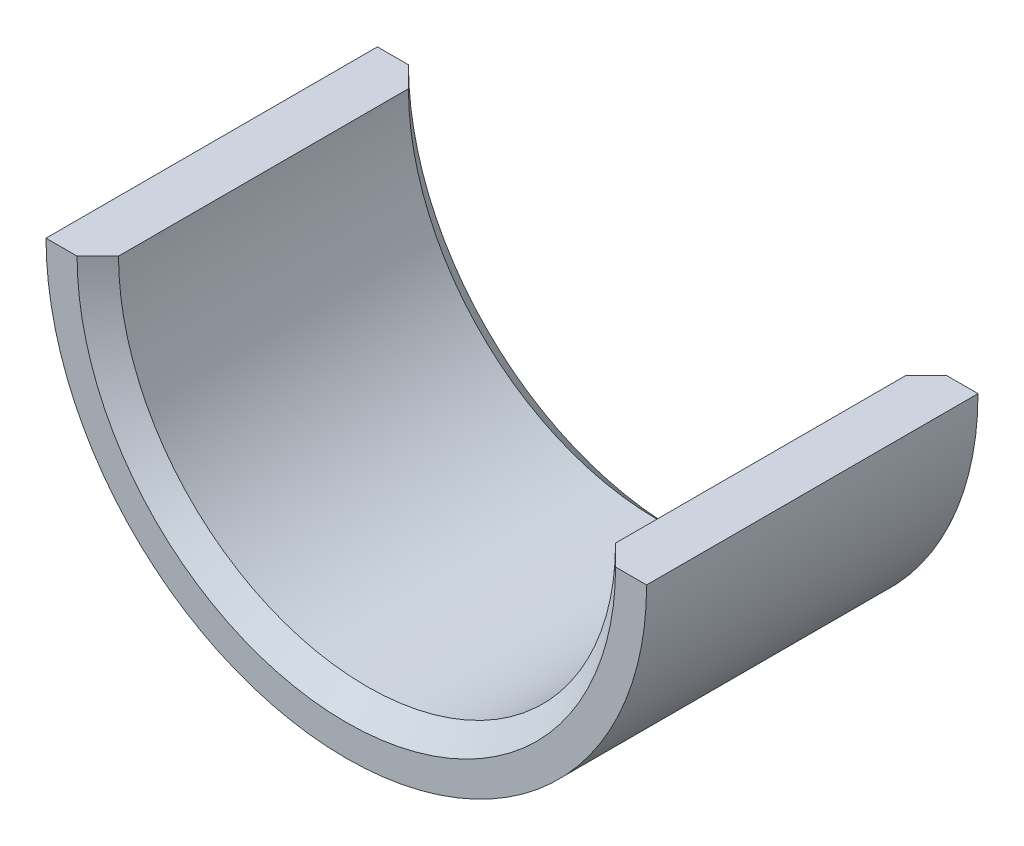
ISO-10303-21;
HEADER;
FILE_DESCRIPTION(('STEP AP214'),'2;1');
FILE_NAME('part.step','',(''),(''),'','','');
FILE_SCHEMA(('AUTOMOTIVE_DESIGN { 1 0 10303 214 1 1 1 1 }'));
ENDSEC;
DATA;
#1=APPLICATION_CONTEXT('core data for automotive mechanical design processes');
#2=APPLICATION_PROTOCOL_DEFINITION('international standard','automotive_design',2000,#1);
#3=PRODUCT_CONTEXT('',#1,'mechanical');
#4=PRODUCT('Part','Part','',(#3));
#5=PRODUCT_RELATED_PRODUCT_CATEGORY('part','',(#4));
#6=PRODUCT_DEFINITION_FORMATION('','',#4);
#7=PRODUCT_DEFINITION_CONTEXT('part definition',#1,'design');
#8=PRODUCT_DEFINITION('design','',#6,#7);
#9=PRODUCT_DEFINITION_SHAPE('','',#8);
#10=(LENGTH_UNIT() NAMED_UNIT(*) SI_UNIT(.MILLI.,.METRE.));
#11=(NAMED_UNIT(*) PLANE_ANGLE_UNIT() SI_UNIT($,.RADIAN.));
#12=(NAMED_UNIT(*) SI_UNIT($,.STERADIAN.) SOLID_ANGLE_UNIT());
#13=UNCERTAINTY_MEASURE_WITH_UNIT(LENGTH_MEASURE(1.E-05),#10,'distance_accuracy_value','');
#14=(GEOMETRIC_REPRESENTATION_CONTEXT(3) GLOBAL_UNCERTAINTY_ASSIGNED_CONTEXT((#13)) GLOBAL_UNIT_ASSIGNED_CONTEXT((#10,
#11,#12)) REPRESENTATION_CONTEXT('',''));
#15=CARTESIAN_POINT('',(0.,0.,0.));
#16=DIRECTION('',(0.,0.,1.));
#17=DIRECTION('',(1.,0.,0.));
#18=AXIS2_PLACEMENT_3D('',#15,#16,#17);
#19=CARTESIAN_POINT('',(34.3713198515824,-30.64120754575,14.01));
#20=DIRECTION('',(0.,-1.,0.));
#21=DIRECTION('',(0.,0.,-1.));
#22=AXIS2_PLACEMENT_3D('',#19,#20,#21);
#23=PLANE('',#22);
#24=DIRECTION('',(1.,0.,0.));
#25=VECTOR('',#24,1.);
#26=CARTESIAN_POINT('',(0.,-30.64120754575,14.));
#27=LINE('',#26,#25);
#28=CARTESIAN_POINT('',(-14.5,-30.64120754575,14.));
#29=VERTEX_POINT('',#28);
#30=CARTESIAN_POINT('',(-13.,-30.64120754575,14.));
#31=VERTEX_POINT('',#30);
#32=EDGE_CURVE('E104',#29,#31,#27,.T.);
#33=ORIENTED_EDGE('',*,*,#32,.T.);
#34=DIRECTION('',(0.707106781186553,0.,-0.707106781186542));
#35=VECTOR('',#34,1.);
#36=CARTESIAN_POINT('',(0.,-30.64120754575,1.00000000000018));
#37=LINE('',#36,#35);
#38=CARTESIAN_POINT('',(-12.,-30.64120754575,13.));
#39=VERTEX_POINT('',#38);
#40=EDGE_CURVE('E118',#31,#39,#37,.T.);
#41=ORIENTED_EDGE('',*,*,#40,.T.);
#42=DIRECTION('',(0.,0.,-1.));
#43=VECTOR('',#42,1.);
#44=CARTESIAN_POINT('',(-12.,-30.64120754575,12.));
#45=LINE('',#44,#43);
#46=CARTESIAN_POINT('',(-12.,-30.64120754575,-0.99999999999999));
#47=VERTEX_POINT('',#46);
#48=EDGE_CURVE('E103',#39,#47,#45,.T.);
#49=ORIENTED_EDGE('',*,*,#48,.T.);
#50=DIRECTION('',(-0.707106781186548,0.,-0.707106781186547));
#51=VECTOR('',#50,1.);
#52=CARTESIAN_POINT('',(0.,-30.64120754575,11.));
#53=LINE('',#52,#51);
#54=CARTESIAN_POINT('',(-13.,-30.64120754575,-2.));
#55=VERTEX_POINT('',#54);
#56=EDGE_CURVE('E111',#47,#55,#53,.T.);
#57=ORIENTED_EDGE('',*,*,#56,.T.);
#58=DIRECTION('',(1.,0.,0.));
#59=VECTOR('',#58,1.);
#60=CARTESIAN_POINT('',(0.,-30.64120754575,-2.));
#61=LINE('',#60,#59);
#62=CARTESIAN_POINT('',(-14.5,-30.64120754575,-2.));
#63=VERTEX_POINT('',#62);
#64=EDGE_CURVE('E124',#63,#55,#61,.T.);
#65=ORIENTED_EDGE('',*,*,#64,.F.);
#66=DIRECTION('',(0.,0.,-1.));
#67=VECTOR('',#66,1.);
#68=CARTESIAN_POINT('',(-14.5,-30.64120754575,14.01));
#69=LINE('',#68,#67);
#70=EDGE_CURVE('E64',#63,#29,#69,.F.);
#71=ORIENTED_EDGE('',*,*,#70,.T.);
#72=EDGE_LOOP('',(#33,#41,#49,#57,#65,#71));
#73=FACE_BOUND('',#72,.T.);
#74=ADVANCED_FACE('F39',(#73),#23,.F.);
#75=CARTESIAN_POINT('',(13.,-30.64120754575,14.));
#76=VERTEX_POINT('',#75);
#77=CARTESIAN_POINT('',(14.5,-30.64120754575,14.));
#78=VERTEX_POINT('',#77);
#79=EDGE_CURVE('E128',#76,#78,#27,.T.);
#80=ORIENTED_EDGE('',*,*,#79,.T.);
#81=DIRECTION('',(0.,0.,-1.));
#82=VECTOR('',#81,1.);
#83=CARTESIAN_POINT('',(14.5,-30.64120754575,14.01));
#84=LINE('',#83,#82);
#85=CARTESIAN_POINT('',(14.5,-30.64120754575,-2.));
#86=VERTEX_POINT('',#85);
#87=EDGE_CURVE('E43',#78,#86,#84,.T.);
#88=ORIENTED_EDGE('',*,*,#87,.T.);
#89=CARTESIAN_POINT('',(13.,-30.64120754575,-2.));
#90=VERTEX_POINT('',#89);
#91=EDGE_CURVE('E56',#90,#86,#61,.T.);
#92=ORIENTED_EDGE('',*,*,#91,.F.);
#93=DIRECTION('',(-0.707106781186548,0.,0.707106781186547));
#94=VECTOR('',#93,1.);
#95=CARTESIAN_POINT('',(0.,-30.64120754575,11.));
#96=LINE('',#95,#94);
#97=CARTESIAN_POINT('',(12.,-30.64120754575,-0.99999999999999));
#98=VERTEX_POINT('',#97);
#99=EDGE_CURVE('E106',#90,#98,#96,.T.);
#100=ORIENTED_EDGE('',*,*,#99,.T.);
#101=DIRECTION('',(0.,0.,-1.));
#102=VECTOR('',#101,1.);
#103=CARTESIAN_POINT('',(12.,-30.64120754575,12.));
#104=LINE('',#103,#102);
#105=CARTESIAN_POINT('',(12.,-30.64120754575,13.));
#106=VERTEX_POINT('',#105);
#107=EDGE_CURVE('E97',#98,#106,#104,.F.);
#108=ORIENTED_EDGE('',*,*,#107,.T.);
#109=DIRECTION('',(0.707106781186553,0.,0.707106781186542));
#110=VECTOR('',#109,1.);
#111=CARTESIAN_POINT('',(0.,-30.64120754575,1.00000000000018));
#112=LINE('',#111,#110);
#113=EDGE_CURVE('E130',#106,#76,#112,.T.);
#114=ORIENTED_EDGE('',*,*,#113,.T.);
#115=EDGE_LOOP('',(#80,#88,#92,#100,#108,#114));
#116=FACE_BOUND('',#115,.T.);
#117=ADVANCED_FACE('F108',(#116),#23,.F.);
#118=CARTESIAN_POINT('',(0.,-30.64120754575,14.01));
#119=DIRECTION('',(0.,0.,-1.));
#120=DIRECTION('',(-1.,0.,0.));
#121=AXIS2_PLACEMENT_3D('',#118,#119,#120);
#122=CYLINDRICAL_SURFACE('',#121,14.5);
#123=CARTESIAN_POINT('',(0.,-30.64120754575,14.));
#124=DIRECTION('',(0.,0.,1.));
#125=DIRECTION('',(1.,0.,0.));
#126=AXIS2_PLACEMENT_3D('',#123,#124,#125);
#127=CIRCLE('',#126,14.5);
#128=EDGE_CURVE('E137',#29,#78,#127,.T.);
#129=ORIENTED_EDGE('',*,*,#128,.F.);
#130=ORIENTED_EDGE('',*,*,#70,.F.);
#131=CARTESIAN_POINT('',(0.,-30.64120754575,-2.));
#132=DIRECTION('',(0.,0.,1.));
#133=DIRECTION('',(1.,0.,0.));
#134=AXIS2_PLACEMENT_3D('',#131,#132,#133);
#135=CIRCLE('',#134,14.5);
#136=EDGE_CURVE('E122',#63,#86,#135,.T.);
#137=ORIENTED_EDGE('',*,*,#136,.T.);
#138=ORIENTED_EDGE('',*,*,#87,.F.);
#139=EDGE_LOOP('',(#129,#130,#137,#138));
#140=FACE_BOUND('',#139,.T.);
#141=ADVANCED_FACE('F135',(#140),#122,.T.);
#142=CARTESIAN_POINT('',(0.,-30.64120754575,14.));
#143=DIRECTION('',(0.,0.,1.));
#144=DIRECTION('',(1.,0.,0.));
#145=AXIS2_PLACEMENT_3D('',#142,#143,#144);
#146=PLANE('',#145);
#147=ORIENTED_EDGE('',*,*,#32,.F.);
#148=ORIENTED_EDGE('',*,*,#128,.T.);
#149=ORIENTED_EDGE('',*,*,#79,.F.);
#150=CARTESIAN_POINT('',(0.,-30.64120754575,14.));
#151=DIRECTION('',(0.,0.,1.));
#152=DIRECTION('',(1.,0.,0.));
#153=AXIS2_PLACEMENT_3D('',#150,#151,#152);
#154=CIRCLE('',#153,13.);
#155=EDGE_CURVE('E140',#76,#31,#154,.F.);
#156=ORIENTED_EDGE('',*,*,#155,.T.);
#157=EDGE_LOOP('',(#147,#148,#149,#156));
#158=FACE_BOUND('',#157,.T.);
#159=ADVANCED_FACE('F145',(#158),#146,.T.);
#160=CARTESIAN_POINT('',(0.,-30.64120754575,-2.));
#161=DIRECTION('',(0.,0.,1.));
#162=DIRECTION('',(1.,0.,0.));
#163=AXIS2_PLACEMENT_3D('',#160,#161,#162);
#164=PLANE('',#163);
#165=ORIENTED_EDGE('',*,*,#136,.F.);
#166=ORIENTED_EDGE('',*,*,#64,.T.);
#167=CARTESIAN_POINT('',(0.,-30.64120754575,-2.));
#168=DIRECTION('',(0.,0.,1.));
#169=DIRECTION('',(1.,0.,0.));
#170=AXIS2_PLACEMENT_3D('',#167,#168,#169);
#171=CIRCLE('',#170,13.);
#172=EDGE_CURVE('E116',#55,#90,#171,.T.);
#173=ORIENTED_EDGE('',*,*,#172,.T.);
#174=ORIENTED_EDGE('',*,*,#91,.T.);
#175=EDGE_LOOP('',(#165,#166,#173,#174));
#176=FACE_BOUND('',#175,.T.);
#177=ADVANCED_FACE('F41',(#176),#164,.F.);
#178=CARTESIAN_POINT('',(0.,-30.64120754575,12.));
#179=DIRECTION('',(0.,0.,-1.));
#180=DIRECTION('',(-1.,0.,0.));
#181=AXIS2_PLACEMENT_3D('',#178,#179,#180);
#182=CYLINDRICAL_SURFACE('',#181,12.);
#183=ORIENTED_EDGE('',*,*,#48,.F.);
#184=CARTESIAN_POINT('',(0.,-30.64120754575,13.));
#185=DIRECTION('',(0.,0.,1.));
#186=DIRECTION('',(1.,0.,0.));
#187=AXIS2_PLACEMENT_3D('',#184,#185,#186);
#188=CIRCLE('',#187,12.);
#189=EDGE_CURVE('E48',#39,#106,#188,.T.);
#190=ORIENTED_EDGE('',*,*,#189,.T.);
#191=ORIENTED_EDGE('',*,*,#107,.F.);
#192=CARTESIAN_POINT('',(0.,-30.64120754575,-0.99999999999999));
#193=DIRECTION('',(0.,0.,1.));
#194=DIRECTION('',(1.,0.,0.));
#195=AXIS2_PLACEMENT_3D('',#192,#193,#194);
#196=CIRCLE('',#195,12.);
#197=EDGE_CURVE('E11',#98,#47,#196,.F.);
#198=ORIENTED_EDGE('',*,*,#197,.T.);
#199=EDGE_LOOP('',(#183,#190,#191,#198));
#200=FACE_BOUND('',#199,.T.);
#201=ADVANCED_FACE('F99',(#200),#182,.F.);
#202=CARTESIAN_POINT('',(0.,-30.64120754575,-2.));
#203=DIRECTION('',(0.,0.,-1.));
#204=DIRECTION('',(-1.,0.,0.));
#205=AXIS2_PLACEMENT_3D('',#202,#203,#204);
#206=CONICAL_SURFACE('',#205,13.,0.785398163397448);
#207=ORIENTED_EDGE('',*,*,#56,.F.);
#208=ORIENTED_EDGE('',*,*,#197,.F.);
#209=ORIENTED_EDGE('',*,*,#99,.F.);
#210=ORIENTED_EDGE('',*,*,#172,.F.);
#211=EDGE_LOOP('',(#207,#208,#209,#210));
#212=FACE_BOUND('',#211,.T.);
#213=ADVANCED_FACE('F113',(#212),#206,.F.);
#214=CARTESIAN_POINT('',(0.,-30.64120754575,13.));
#215=DIRECTION('',(0.,0.,1.));
#216=DIRECTION('',(1.,0.,0.));
#217=AXIS2_PLACEMENT_3D('',#214,#215,#216);
#218=CONICAL_SURFACE('',#217,12.,0.785398163397456);
#219=ORIENTED_EDGE('',*,*,#113,.F.);
#220=ORIENTED_EDGE('',*,*,#189,.F.);
#221=ORIENTED_EDGE('',*,*,#40,.F.);
#222=ORIENTED_EDGE('',*,*,#155,.F.);
#223=EDGE_LOOP('',(#219,#220,#221,#222));
#224=FACE_BOUND('',#223,.T.);
#225=ADVANCED_FACE('F147',(#224),#218,.F.);
#226=CLOSED_SHELL('',(#74,#117,#141,#159,#177,#201,#213,#225));
#227=MANIFOLD_SOLID_BREP('B2',#226);
#228=ADVANCED_BREP_SHAPE_REPRESENTATION('',(#18,#227),#14);
#229=SHAPE_DEFINITION_REPRESENTATION(#9,#228);
ENDSEC;
END-ISO-10303-21;
